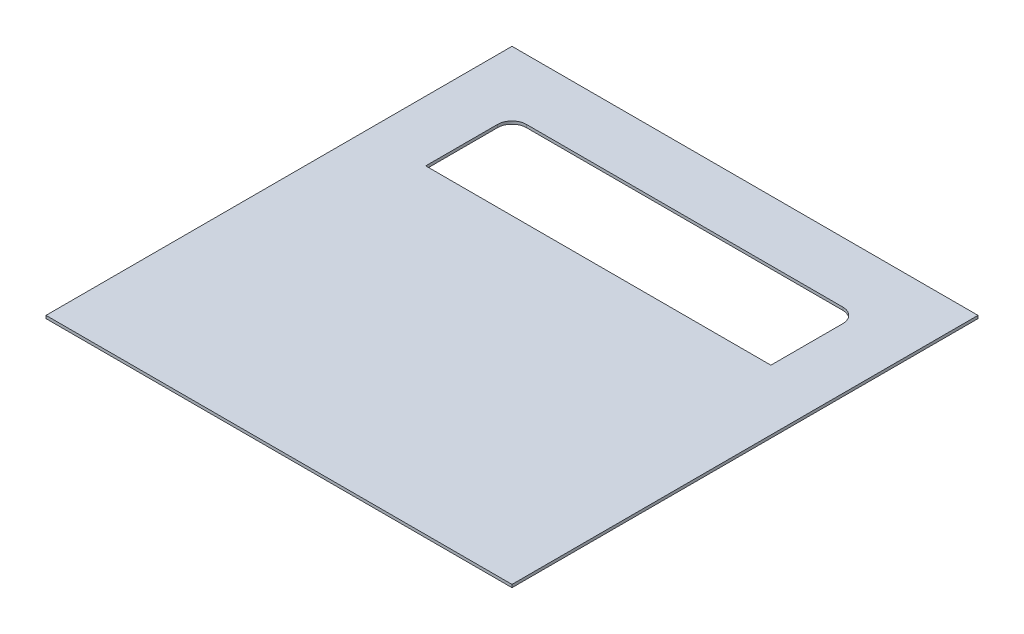
ISO-10303-21;
HEADER;
FILE_DESCRIPTION(('STEP AP214'),'2;1');
FILE_NAME('part.step','',(''),(''),'','','');
FILE_SCHEMA(('AUTOMOTIVE_DESIGN { 1 0 10303 214 1 1 1 1 }'));
ENDSEC;
DATA;
#1=APPLICATION_CONTEXT('core data for automotive mechanical design processes');
#2=APPLICATION_PROTOCOL_DEFINITION('international standard','automotive_design',2000,#1);
#3=PRODUCT_CONTEXT('',#1,'mechanical');
#4=PRODUCT('Part','Part','',(#3));
#5=PRODUCT_RELATED_PRODUCT_CATEGORY('part','',(#4));
#6=PRODUCT_DEFINITION_FORMATION('','',#4);
#7=PRODUCT_DEFINITION_CONTEXT('part definition',#1,'design');
#8=PRODUCT_DEFINITION('design','',#6,#7);
#9=PRODUCT_DEFINITION_SHAPE('','',#8);
#10=(LENGTH_UNIT() NAMED_UNIT(*) SI_UNIT(.MILLI.,.METRE.));
#11=(NAMED_UNIT(*) PLANE_ANGLE_UNIT() SI_UNIT($,.RADIAN.));
#12=(NAMED_UNIT(*) SI_UNIT($,.STERADIAN.) SOLID_ANGLE_UNIT());
#13=UNCERTAINTY_MEASURE_WITH_UNIT(LENGTH_MEASURE(1.E-05),#10,'distance_accuracy_value','');
#14=(GEOMETRIC_REPRESENTATION_CONTEXT(3) GLOBAL_UNCERTAINTY_ASSIGNED_CONTEXT((#13)) GLOBAL_UNIT_ASSIGNED_CONTEXT((#10,
#11,#12)) REPRESENTATION_CONTEXT('',''));
#15=CARTESIAN_POINT('',(0.,0.,0.));
#16=DIRECTION('',(0.,0.,1.));
#17=DIRECTION('',(1.,0.,0.));
#18=AXIS2_PLACEMENT_3D('',#15,#16,#17);
#19=CARTESIAN_POINT('',(81.,1.,81.));
#20=DIRECTION('',(-1.,0.,0.));
#21=DIRECTION('',(0.,0.,1.));
#22=AXIS2_PLACEMENT_3D('',#19,#20,#21);
#23=PLANE('',#22);
#24=DIRECTION('',(0.,0.,-1.));
#25=VECTOR('',#24,1.);
#26=CARTESIAN_POINT('',(81.,0.,81.));
#27=LINE('',#26,#25);
#28=CARTESIAN_POINT('',(81.,0.,81.));
#29=VERTEX_POINT('',#28);
#30=CARTESIAN_POINT('',(81.,0.,-81.));
#31=VERTEX_POINT('',#30);
#32=EDGE_CURVE('E129',#29,#31,#27,.T.);
#33=ORIENTED_EDGE('',*,*,#32,.T.);
#34=DIRECTION('',(0.,-1.,0.));
#35=VECTOR('',#34,1.);
#36=CARTESIAN_POINT('',(81.,1.,-81.));
#37=LINE('',#36,#35);
#38=CARTESIAN_POINT('',(81.,1.,-81.));
#39=VERTEX_POINT('',#38);
#40=EDGE_CURVE('E177',#39,#31,#37,.T.);
#41=ORIENTED_EDGE('',*,*,#40,.F.);
#42=DIRECTION('',(0.,0.,-1.));
#43=VECTOR('',#42,1.);
#44=CARTESIAN_POINT('',(81.,1.,81.));
#45=LINE('',#44,#43);
#46=CARTESIAN_POINT('',(81.,1.,81.));
#47=VERTEX_POINT('',#46);
#48=EDGE_CURVE('E151',#47,#39,#45,.T.);
#49=ORIENTED_EDGE('',*,*,#48,.F.);
#50=DIRECTION('',(0.,-1.,0.));
#51=VECTOR('',#50,1.);
#52=CARTESIAN_POINT('',(81.,1.,81.));
#53=LINE('',#52,#51);
#54=EDGE_CURVE('E161',#47,#29,#53,.T.);
#55=ORIENTED_EDGE('',*,*,#54,.T.);
#56=EDGE_LOOP('',(#33,#41,#49,#55));
#57=FACE_BOUND('',#56,.T.);
#58=ADVANCED_FACE('F33',(#57),#23,.F.);
#59=CARTESIAN_POINT('',(-81.,1.,-81.));
#60=DIRECTION('',(0.,0.,1.));
#61=DIRECTION('',(1.,0.,0.));
#62=AXIS2_PLACEMENT_3D('',#59,#60,#61);
#63=PLANE('',#62);
#64=DIRECTION('',(-1.,0.,0.));
#65=VECTOR('',#64,1.);
#66=CARTESIAN_POINT('',(-81.,0.,-81.));
#67=LINE('',#66,#65);
#68=CARTESIAN_POINT('',(-81.,0.,-81.));
#69=VERTEX_POINT('',#68);
#70=EDGE_CURVE('E164',#31,#69,#67,.T.);
#71=ORIENTED_EDGE('',*,*,#70,.T.);
#72=DIRECTION('',(0.,-1.,0.));
#73=VECTOR('',#72,1.);
#74=CARTESIAN_POINT('',(-81.,1.,-81.));
#75=LINE('',#74,#73);
#76=CARTESIAN_POINT('',(-81.,1.,-81.));
#77=VERTEX_POINT('',#76);
#78=EDGE_CURVE('E174',#77,#69,#75,.T.);
#79=ORIENTED_EDGE('',*,*,#78,.F.);
#80=DIRECTION('',(-1.,0.,0.));
#81=VECTOR('',#80,1.);
#82=CARTESIAN_POINT('',(-81.,1.,-81.));
#83=LINE('',#82,#81);
#84=EDGE_CURVE('E154',#39,#77,#83,.T.);
#85=ORIENTED_EDGE('',*,*,#84,.F.);
#86=ORIENTED_EDGE('',*,*,#40,.T.);
#87=EDGE_LOOP('',(#71,#79,#85,#86));
#88=FACE_BOUND('',#87,.T.);
#89=ADVANCED_FACE('F208',(#88),#63,.F.);
#90=CARTESIAN_POINT('',(-81.,1.,81.));
#91=DIRECTION('',(1.,0.,0.));
#92=DIRECTION('',(0.,0.,-1.));
#93=AXIS2_PLACEMENT_3D('',#90,#91,#92);
#94=PLANE('',#93);
#95=DIRECTION('',(0.,0.,1.));
#96=VECTOR('',#95,1.);
#97=CARTESIAN_POINT('',(-81.,0.,81.));
#98=LINE('',#97,#96);
#99=CARTESIAN_POINT('',(-81.,0.,81.));
#100=VERTEX_POINT('',#99);
#101=EDGE_CURVE('E166',#69,#100,#98,.T.);
#102=ORIENTED_EDGE('',*,*,#101,.T.);
#103=DIRECTION('',(0.,-1.,0.));
#104=VECTOR('',#103,1.);
#105=CARTESIAN_POINT('',(-81.,1.,81.));
#106=LINE('',#105,#104);
#107=CARTESIAN_POINT('',(-81.,1.,81.));
#108=VERTEX_POINT('',#107);
#109=EDGE_CURVE('E171',#108,#100,#106,.T.);
#110=ORIENTED_EDGE('',*,*,#109,.F.);
#111=DIRECTION('',(0.,0.,1.));
#112=VECTOR('',#111,1.);
#113=CARTESIAN_POINT('',(-81.,1.,81.));
#114=LINE('',#113,#112);
#115=EDGE_CURVE('E157',#77,#108,#114,.T.);
#116=ORIENTED_EDGE('',*,*,#115,.F.);
#117=ORIENTED_EDGE('',*,*,#78,.T.);
#118=EDGE_LOOP('',(#102,#110,#116,#117));
#119=FACE_BOUND('',#118,.T.);
#120=ADVANCED_FACE('F213',(#119),#94,.F.);
#121=CARTESIAN_POINT('',(-81.,1.,81.));
#122=DIRECTION('',(0.,0.,-1.));
#123=DIRECTION('',(-1.,0.,0.));
#124=AXIS2_PLACEMENT_3D('',#121,#122,#123);
#125=PLANE('',#124);
#126=DIRECTION('',(1.,0.,0.));
#127=VECTOR('',#126,1.);
#128=CARTESIAN_POINT('',(-81.,0.,81.));
#129=LINE('',#128,#127);
#130=EDGE_CURVE('E155',#100,#29,#129,.T.);
#131=ORIENTED_EDGE('',*,*,#130,.T.);
#132=ORIENTED_EDGE('',*,*,#54,.F.);
#133=DIRECTION('',(1.,0.,0.));
#134=VECTOR('',#133,1.);
#135=CARTESIAN_POINT('',(-81.,1.,81.));
#136=LINE('',#135,#134);
#137=EDGE_CURVE('E159',#108,#47,#136,.T.);
#138=ORIENTED_EDGE('',*,*,#137,.F.);
#139=ORIENTED_EDGE('',*,*,#109,.T.);
#140=EDGE_LOOP('',(#131,#132,#138,#139));
#141=FACE_BOUND('',#140,.T.);
#142=ADVANCED_FACE('F219',(#141),#125,.F.);
#143=CARTESIAN_POINT('',(0.,1.,0.));
#144=DIRECTION('',(0.,-1.,0.));
#145=DIRECTION('',(0.,0.,-1.));
#146=AXIS2_PLACEMENT_3D('',#143,#144,#145);
#147=PLANE('',#146);
#148=DIRECTION('',(-1.,0.,0.));
#149=VECTOR('',#148,1.);
#150=CARTESIAN_POINT('',(-60.,1.,-60.));
#151=LINE('',#150,#149);
#152=CARTESIAN_POINT('',(55.,1.,-60.));
#153=VERTEX_POINT('',#152);
#154=CARTESIAN_POINT('',(-55.,1.,-60.));
#155=VERTEX_POINT('',#154);
#156=EDGE_CURVE('E136',#153,#155,#151,.T.);
#157=ORIENTED_EDGE('',*,*,#156,.F.);
#158=CARTESIAN_POINT('',(55.,1.,-55.));
#159=DIRECTION('',(0.,-1.,0.));
#160=DIRECTION('',(0.,0.,-1.));
#161=AXIS2_PLACEMENT_3D('',#158,#159,#160);
#162=CIRCLE('',#161,5.);
#163=CARTESIAN_POINT('',(60.,1.,-55.));
#164=VERTEX_POINT('',#163);
#165=EDGE_CURVE('E135',#153,#164,#162,.T.);
#166=ORIENTED_EDGE('',*,*,#165,.T.);
#167=DIRECTION('',(0.,0.,-1.));
#168=VECTOR('',#167,1.);
#169=CARTESIAN_POINT('',(60.,1.,-30.));
#170=LINE('',#169,#168);
#171=CARTESIAN_POINT('',(60.,1.,-30.));
#172=VERTEX_POINT('',#171);
#173=EDGE_CURVE('E114',#172,#164,#170,.T.);
#174=ORIENTED_EDGE('',*,*,#173,.F.);
#175=DIRECTION('',(1.,0.,0.));
#176=VECTOR('',#175,1.);
#177=CARTESIAN_POINT('',(-60.,1.,-30.));
#178=LINE('',#177,#176);
#179=CARTESIAN_POINT('',(-60.,1.,-30.));
#180=VERTEX_POINT('',#179);
#181=EDGE_CURVE('E126',#180,#172,#178,.T.);
#182=ORIENTED_EDGE('',*,*,#181,.F.);
#183=DIRECTION('',(0.,0.,1.));
#184=VECTOR('',#183,1.);
#185=CARTESIAN_POINT('',(-60.,1.,-30.));
#186=LINE('',#185,#184);
#187=CARTESIAN_POINT('',(-60.,1.,-55.));
#188=VERTEX_POINT('',#187);
#189=EDGE_CURVE('E141',#188,#180,#186,.T.);
#190=ORIENTED_EDGE('',*,*,#189,.F.);
#191=CARTESIAN_POINT('',(-55.,1.,-55.));
#192=DIRECTION('',(0.,-1.,0.));
#193=DIRECTION('',(0.,0.,-1.));
#194=AXIS2_PLACEMENT_3D('',#191,#192,#193);
#195=CIRCLE('',#194,5.);
#196=EDGE_CURVE('E11',#188,#155,#195,.T.);
#197=ORIENTED_EDGE('',*,*,#196,.T.);
#198=EDGE_LOOP('',(#157,#166,#174,#182,#190,#197));
#199=FACE_BOUND('',#198,.T.);
#200=ORIENTED_EDGE('',*,*,#48,.T.);
#201=ORIENTED_EDGE('',*,*,#84,.T.);
#202=ORIENTED_EDGE('',*,*,#115,.T.);
#203=ORIENTED_EDGE('',*,*,#137,.T.);
#204=EDGE_LOOP('',(#200,#201,#202,#203));
#205=FACE_BOUND('',#204,.T.);
#206=ADVANCED_FACE('F132',(#199,#205),#147,.F.);
#207=CARTESIAN_POINT('',(0.,0.,0.));
#208=DIRECTION('',(0.,-1.,0.));
#209=DIRECTION('',(0.,0.,-1.));
#210=AXIS2_PLACEMENT_3D('',#207,#208,#209);
#211=PLANE('',#210);
#212=DIRECTION('',(0.,0.,1.));
#213=VECTOR('',#212,1.);
#214=CARTESIAN_POINT('',(60.,0.,-30.));
#215=LINE('',#214,#213);
#216=CARTESIAN_POINT('',(60.,0.,-55.));
#217=VERTEX_POINT('',#216);
#218=CARTESIAN_POINT('',(60.,0.,-30.));
#219=VERTEX_POINT('',#218);
#220=EDGE_CURVE('E117',#217,#219,#215,.T.);
#221=ORIENTED_EDGE('',*,*,#220,.F.);
#222=CARTESIAN_POINT('',(55.,0.,-55.));
#223=DIRECTION('',(0.,-1.,0.));
#224=DIRECTION('',(0.,0.,-1.));
#225=AXIS2_PLACEMENT_3D('',#222,#223,#224);
#226=CIRCLE('',#225,5.);
#227=CARTESIAN_POINT('',(55.,0.,-60.));
#228=VERTEX_POINT('',#227);
#229=EDGE_CURVE('E188',#217,#228,#226,.F.);
#230=ORIENTED_EDGE('',*,*,#229,.T.);
#231=DIRECTION('',(1.,0.,0.));
#232=VECTOR('',#231,1.);
#233=CARTESIAN_POINT('',(-60.,0.,-60.));
#234=LINE('',#233,#232);
#235=CARTESIAN_POINT('',(-55.,0.,-60.));
#236=VERTEX_POINT('',#235);
#237=EDGE_CURVE('E122',#236,#228,#234,.T.);
#238=ORIENTED_EDGE('',*,*,#237,.F.);
#239=CARTESIAN_POINT('',(-55.,0.,-55.));
#240=DIRECTION('',(0.,-1.,0.));
#241=DIRECTION('',(0.,0.,-1.));
#242=AXIS2_PLACEMENT_3D('',#239,#240,#241);
#243=CIRCLE('',#242,5.);
#244=CARTESIAN_POINT('',(-60.,0.,-55.));
#245=VERTEX_POINT('',#244);
#246=EDGE_CURVE('E41',#236,#245,#243,.F.);
#247=ORIENTED_EDGE('',*,*,#246,.T.);
#248=DIRECTION('',(0.,0.,-1.));
#249=VECTOR('',#248,1.);
#250=CARTESIAN_POINT('',(-60.,0.,-30.));
#251=LINE('',#250,#249);
#252=CARTESIAN_POINT('',(-60.,0.,-30.));
#253=VERTEX_POINT('',#252);
#254=EDGE_CURVE('E146',#253,#245,#251,.T.);
#255=ORIENTED_EDGE('',*,*,#254,.F.);
#256=DIRECTION('',(-1.,0.,0.));
#257=VECTOR('',#256,1.);
#258=CARTESIAN_POINT('',(-60.,0.,-30.));
#259=LINE('',#258,#257);
#260=EDGE_CURVE('E138',#219,#253,#259,.T.);
#261=ORIENTED_EDGE('',*,*,#260,.F.);
#262=EDGE_LOOP('',(#221,#230,#238,#247,#255,#261));
#263=FACE_BOUND('',#262,.T.);
#264=ORIENTED_EDGE('',*,*,#32,.F.);
#265=ORIENTED_EDGE('',*,*,#130,.F.);
#266=ORIENTED_EDGE('',*,*,#101,.F.);
#267=ORIENTED_EDGE('',*,*,#70,.F.);
#268=EDGE_LOOP('',(#264,#265,#266,#267));
#269=FACE_BOUND('',#268,.T.);
#270=ADVANCED_FACE('F190',(#263,#269),#211,.T.);
#271=CARTESIAN_POINT('',(60.,1.001,-30.));
#272=DIRECTION('',(1.,0.,0.));
#273=DIRECTION('',(0.,0.,-1.));
#274=AXIS2_PLACEMENT_3D('',#271,#272,#273);
#275=PLANE('',#274);
#276=ORIENTED_EDGE('',*,*,#173,.T.);
#277=DIRECTION('',(0.,-1.,0.));
#278=VECTOR('',#277,1.);
#279=CARTESIAN_POINT('',(60.,0.,-55.));
#280=LINE('',#279,#278);
#281=EDGE_CURVE('E180',#164,#217,#280,.T.);
#282=ORIENTED_EDGE('',*,*,#281,.T.);
#283=ORIENTED_EDGE('',*,*,#220,.T.);
#284=DIRECTION('',(0.,-1.,0.));
#285=VECTOR('',#284,1.);
#286=CARTESIAN_POINT('',(60.,1.001,-30.));
#287=LINE('',#286,#285);
#288=EDGE_CURVE('E109',#172,#219,#287,.T.);
#289=ORIENTED_EDGE('',*,*,#288,.F.);
#290=EDGE_LOOP('',(#276,#282,#283,#289));
#291=FACE_BOUND('',#290,.T.);
#292=ADVANCED_FACE('F111',(#291),#275,.F.);
#293=CARTESIAN_POINT('',(-60.,1.001,-60.));
#294=DIRECTION('',(0.,0.,-1.));
#295=DIRECTION('',(-1.,0.,0.));
#296=AXIS2_PLACEMENT_3D('',#293,#294,#295);
#297=PLANE('',#296);
#298=ORIENTED_EDGE('',*,*,#237,.T.);
#299=DIRECTION('',(0.,-1.,0.));
#300=VECTOR('',#299,1.);
#301=CARTESIAN_POINT('',(55.,1.,-60.));
#302=LINE('',#301,#300);
#303=EDGE_CURVE('E185',#228,#153,#302,.F.);
#304=ORIENTED_EDGE('',*,*,#303,.T.);
#305=ORIENTED_EDGE('',*,*,#156,.T.);
#306=DIRECTION('',(0.,-1.,0.));
#307=VECTOR('',#306,1.);
#308=CARTESIAN_POINT('',(-55.,0.,-60.));
#309=LINE('',#308,#307);
#310=EDGE_CURVE('E182',#155,#236,#309,.T.);
#311=ORIENTED_EDGE('',*,*,#310,.T.);
#312=EDGE_LOOP('',(#298,#304,#305,#311));
#313=FACE_BOUND('',#312,.T.);
#314=ADVANCED_FACE('F195',(#313),#297,.F.);
#315=CARTESIAN_POINT('',(-60.,1.001,-30.));
#316=DIRECTION('',(-1.,0.,0.));
#317=DIRECTION('',(0.,0.,1.));
#318=AXIS2_PLACEMENT_3D('',#315,#316,#317);
#319=PLANE('',#318);
#320=ORIENTED_EDGE('',*,*,#254,.T.);
#321=DIRECTION('',(0.,-1.,0.));
#322=VECTOR('',#321,1.);
#323=CARTESIAN_POINT('',(-60.,1.,-55.));
#324=LINE('',#323,#322);
#325=EDGE_CURVE('E54',#245,#188,#324,.F.);
#326=ORIENTED_EDGE('',*,*,#325,.T.);
#327=ORIENTED_EDGE('',*,*,#189,.T.);
#328=DIRECTION('',(0.,-1.,0.));
#329=VECTOR('',#328,1.);
#330=CARTESIAN_POINT('',(-60.,1.001,-30.));
#331=LINE('',#330,#329);
#332=EDGE_CURVE('E121',#180,#253,#331,.T.);
#333=ORIENTED_EDGE('',*,*,#332,.T.);
#334=EDGE_LOOP('',(#320,#326,#327,#333));
#335=FACE_BOUND('',#334,.T.);
#336=ADVANCED_FACE('F204',(#335),#319,.F.);
#337=CARTESIAN_POINT('',(-60.,1.001,-30.));
#338=DIRECTION('',(0.,0.,1.));
#339=DIRECTION('',(1.,0.,0.));
#340=AXIS2_PLACEMENT_3D('',#337,#338,#339);
#341=PLANE('',#340);
#342=ORIENTED_EDGE('',*,*,#181,.T.);
#343=ORIENTED_EDGE('',*,*,#288,.T.);
#344=ORIENTED_EDGE('',*,*,#260,.T.);
#345=ORIENTED_EDGE('',*,*,#332,.F.);
#346=EDGE_LOOP('',(#342,#343,#344,#345));
#347=FACE_BOUND('',#346,.T.);
#348=ADVANCED_FACE('F127',(#347),#341,.F.);
#349=CARTESIAN_POINT('',(55.,1.001,-55.));
#350=DIRECTION('',(0.,1.,0.));
#351=DIRECTION('',(0.,0.,1.));
#352=AXIS2_PLACEMENT_3D('',#349,#350,#351);
#353=CYLINDRICAL_SURFACE('',#352,5.);
#354=ORIENTED_EDGE('',*,*,#165,.F.);
#355=ORIENTED_EDGE('',*,*,#303,.F.);
#356=ORIENTED_EDGE('',*,*,#229,.F.);
#357=ORIENTED_EDGE('',*,*,#281,.F.);
#358=EDGE_LOOP('',(#354,#355,#356,#357));
#359=FACE_BOUND('',#358,.T.);
#360=ADVANCED_FACE('F197',(#359),#353,.F.);
#361=CARTESIAN_POINT('',(-55.,1.001,-55.));
#362=DIRECTION('',(0.,1.,0.));
#363=DIRECTION('',(0.,0.,1.));
#364=AXIS2_PLACEMENT_3D('',#361,#362,#363);
#365=CYLINDRICAL_SURFACE('',#364,5.);
#366=ORIENTED_EDGE('',*,*,#196,.F.);
#367=ORIENTED_EDGE('',*,*,#325,.F.);
#368=ORIENTED_EDGE('',*,*,#246,.F.);
#369=ORIENTED_EDGE('',*,*,#310,.F.);
#370=EDGE_LOOP('',(#366,#367,#368,#369));
#371=FACE_BOUND('',#370,.T.);
#372=ADVANCED_FACE('F35',(#371),#365,.F.);
#373=CLOSED_SHELL('',(#58,#89,#120,#142,#206,#270,#292,#314,#336,#348,#360,#372));
#374=MANIFOLD_SOLID_BREP('B2',#373);
#375=ADVANCED_BREP_SHAPE_REPRESENTATION('',(#18,#374),#14);
#376=SHAPE_DEFINITION_REPRESENTATION(#9,#375);
ENDSEC;
END-ISO-10303-21;
